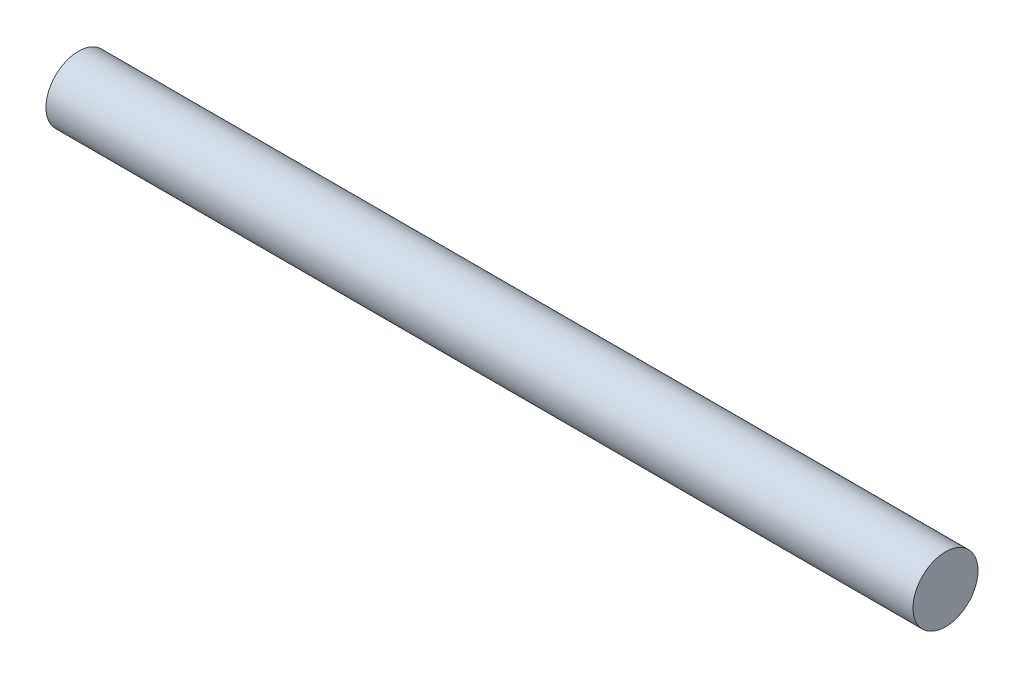
ISO-10303-21;
HEADER;
FILE_DESCRIPTION(('STEP AP214'),'2;1');
FILE_NAME('part.step','',(''),(''),'','','');
FILE_SCHEMA(('AUTOMOTIVE_DESIGN { 1 0 10303 214 1 1 1 1 }'));
ENDSEC;
DATA;
#1=APPLICATION_CONTEXT('core data for automotive mechanical design processes');
#2=APPLICATION_PROTOCOL_DEFINITION('international standard','automotive_design',2000,#1);
#3=PRODUCT_CONTEXT('',#1,'mechanical');
#4=PRODUCT('Part','Part','',(#3));
#5=PRODUCT_RELATED_PRODUCT_CATEGORY('part','',(#4));
#6=PRODUCT_DEFINITION_FORMATION('','',#4);
#7=PRODUCT_DEFINITION_CONTEXT('part definition',#1,'design');
#8=PRODUCT_DEFINITION('design','',#6,#7);
#9=PRODUCT_DEFINITION_SHAPE('','',#8);
#10=(LENGTH_UNIT() NAMED_UNIT(*) SI_UNIT(.MILLI.,.METRE.));
#11=(NAMED_UNIT(*) PLANE_ANGLE_UNIT() SI_UNIT($,.RADIAN.));
#12=(NAMED_UNIT(*) SI_UNIT($,.STERADIAN.) SOLID_ANGLE_UNIT());
#13=UNCERTAINTY_MEASURE_WITH_UNIT(LENGTH_MEASURE(1.E-05),#10,'distance_accuracy_value','');
#14=(GEOMETRIC_REPRESENTATION_CONTEXT(3) GLOBAL_UNCERTAINTY_ASSIGNED_CONTEXT((#13)) GLOBAL_UNIT_ASSIGNED_CONTEXT((#10,
#11,#12)) REPRESENTATION_CONTEXT('',''));
#15=CARTESIAN_POINT('',(0.,0.,0.));
#16=DIRECTION('',(0.,0.,1.));
#17=DIRECTION('',(1.,0.,0.));
#18=AXIS2_PLACEMENT_3D('',#15,#16,#17);
#19=CARTESIAN_POINT('',(100.,0.,0.));
#20=DIRECTION('',(-1.,0.,0.));
#21=DIRECTION('',(0.,0.,1.));
#22=AXIS2_PLACEMENT_3D('',#19,#20,#21);
#23=CYLINDRICAL_SURFACE('',#22,3.75);
#24=CARTESIAN_POINT('',(100.,0.,0.));
#25=DIRECTION('',(1.,0.,0.));
#26=DIRECTION('',(0.,0.,-1.));
#27=AXIS2_PLACEMENT_3D('',#24,#25,#26);
#28=CIRCLE('',#27,3.75);
#29=CARTESIAN_POINT('',(100.,0.,-3.75));
#30=VERTEX_POINT('',#29);
#31=EDGE_CURVE('E10',#30,#30,#28,.T.);
#32=ORIENTED_EDGE('',*,*,#31,.F.);
#33=EDGE_LOOP('',(#32));
#34=FACE_BOUND('',#33,.T.);
#35=CARTESIAN_POINT('',(0.,0.,0.));
#36=DIRECTION('',(1.,0.,0.));
#37=DIRECTION('',(0.,0.,-1.));
#38=AXIS2_PLACEMENT_3D('',#35,#36,#37);
#39=CIRCLE('',#38,3.75);
#40=CARTESIAN_POINT('',(0.,0.,-3.75));
#41=VERTEX_POINT('',#40);
#42=EDGE_CURVE('E34',#41,#41,#39,.T.);
#43=ORIENTED_EDGE('',*,*,#42,.T.);
#44=EDGE_LOOP('',(#43));
#45=FACE_BOUND('',#44,.T.);
#46=ADVANCED_FACE('F31',(#34,#45),#23,.T.);
#47=CARTESIAN_POINT('',(100.,0.,0.));
#48=DIRECTION('',(1.,0.,0.));
#49=DIRECTION('',(0.,0.,-1.));
#50=AXIS2_PLACEMENT_3D('',#47,#48,#49);
#51=PLANE('',#50);
#52=ORIENTED_EDGE('',*,*,#31,.T.);
#53=EDGE_LOOP('',(#52));
#54=FACE_BOUND('',#53,.T.);
#55=ADVANCED_FACE('F46',(#54),#51,.T.);
#56=CARTESIAN_POINT('',(0.,0.,0.));
#57=DIRECTION('',(1.,0.,0.));
#58=DIRECTION('',(0.,0.,-1.));
#59=AXIS2_PLACEMENT_3D('',#56,#57,#58);
#60=PLANE('',#59);
#61=ORIENTED_EDGE('',*,*,#42,.F.);
#62=EDGE_LOOP('',(#61));
#63=FACE_BOUND('',#62,.T.);
#64=ADVANCED_FACE('F44',(#63),#60,.F.);
#65=CLOSED_SHELL('',(#46,#55,#64));
#66=MANIFOLD_SOLID_BREP('B2',#65);
#67=ADVANCED_BREP_SHAPE_REPRESENTATION('',(#18,#66),#14);
#68=SHAPE_DEFINITION_REPRESENTATION(#9,#67);
ENDSEC;
END-ISO-10303-21;
